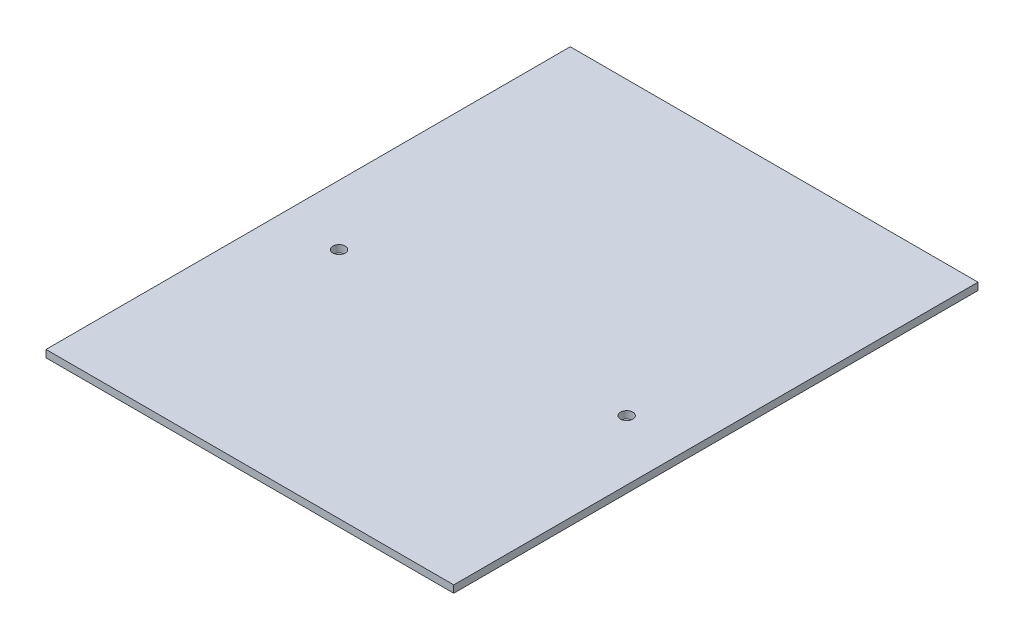
ISO-10303-21;
HEADER;
FILE_DESCRIPTION(('STEP AP214'),'2;1');
FILE_NAME('part.step','',(''),(''),'','','');
FILE_SCHEMA(('AUTOMOTIVE_DESIGN { 1 0 10303 214 1 1 1 1 }'));
ENDSEC;
DATA;
#1=APPLICATION_CONTEXT('core data for automotive mechanical design processes');
#2=APPLICATION_PROTOCOL_DEFINITION('international standard','automotive_design',2000,#1);
#3=PRODUCT_CONTEXT('',#1,'mechanical');
#4=PRODUCT('Part','Part','',(#3));
#5=PRODUCT_RELATED_PRODUCT_CATEGORY('part','',(#4));
#6=PRODUCT_DEFINITION_FORMATION('','',#4);
#7=PRODUCT_DEFINITION_CONTEXT('part definition',#1,'design');
#8=PRODUCT_DEFINITION('design','',#6,#7);
#9=PRODUCT_DEFINITION_SHAPE('','',#8);
#10=(LENGTH_UNIT() NAMED_UNIT(*) SI_UNIT(.MILLI.,.METRE.));
#11=(NAMED_UNIT(*) PLANE_ANGLE_UNIT() SI_UNIT($,.RADIAN.));
#12=(NAMED_UNIT(*) SI_UNIT($,.STERADIAN.) SOLID_ANGLE_UNIT());
#13=UNCERTAINTY_MEASURE_WITH_UNIT(LENGTH_MEASURE(1.E-05),#10,'distance_accuracy_value','');
#14=(GEOMETRIC_REPRESENTATION_CONTEXT(3) GLOBAL_UNCERTAINTY_ASSIGNED_CONTEXT((#13)) GLOBAL_UNIT_ASSIGNED_CONTEXT((#10,
#11,#12)) REPRESENTATION_CONTEXT('',''));
#15=CARTESIAN_POINT('',(0.,0.,0.));
#16=DIRECTION('',(0.,0.,1.));
#17=DIRECTION('',(1.,0.,0.));
#18=AXIS2_PLACEMENT_3D('',#15,#16,#17);
#19=CARTESIAN_POINT('',(0.,6.35,0.));
#20=DIRECTION('',(1.,0.,0.));
#21=DIRECTION('',(0.,0.,-1.));
#22=AXIS2_PLACEMENT_3D('',#19,#20,#21);
#23=PLANE('',#22);
#24=DIRECTION('',(0.,0.,1.));
#25=VECTOR('',#24,1.);
#26=CARTESIAN_POINT('',(0.,0.,0.));
#27=LINE('',#26,#25);
#28=CARTESIAN_POINT('',(0.,0.,-457.2));
#29=VERTEX_POINT('',#28);
#30=CARTESIAN_POINT('',(0.,0.,0.));
#31=VERTEX_POINT('',#30);
#32=EDGE_CURVE('E107',#29,#31,#27,.T.);
#33=ORIENTED_EDGE('',*,*,#32,.T.);
#34=DIRECTION('',(0.,-1.,0.));
#35=VECTOR('',#34,1.);
#36=CARTESIAN_POINT('',(0.,6.35,0.));
#37=LINE('',#36,#35);
#38=CARTESIAN_POINT('',(0.,6.35,0.));
#39=VERTEX_POINT('',#38);
#40=EDGE_CURVE('E11',#39,#31,#37,.T.);
#41=ORIENTED_EDGE('',*,*,#40,.F.);
#42=DIRECTION('',(0.,0.,1.));
#43=VECTOR('',#42,1.);
#44=CARTESIAN_POINT('',(0.,6.35,0.));
#45=LINE('',#44,#43);
#46=CARTESIAN_POINT('',(0.,6.35,-457.2));
#47=VERTEX_POINT('',#46);
#48=EDGE_CURVE('E94',#47,#39,#45,.T.);
#49=ORIENTED_EDGE('',*,*,#48,.F.);
#50=DIRECTION('',(0.,-1.,0.));
#51=VECTOR('',#50,1.);
#52=CARTESIAN_POINT('',(0.,6.35,-457.2));
#53=LINE('',#52,#51);
#54=EDGE_CURVE('E103',#47,#29,#53,.T.);
#55=ORIENTED_EDGE('',*,*,#54,.T.);
#56=EDGE_LOOP('',(#33,#41,#49,#55));
#57=FACE_BOUND('',#56,.T.);
#58=ADVANCED_FACE('F40',(#57),#23,.F.);
#59=CARTESIAN_POINT('',(0.,6.35,0.));
#60=DIRECTION('',(0.,0.,-1.));
#61=DIRECTION('',(-1.,0.,0.));
#62=AXIS2_PLACEMENT_3D('',#59,#60,#61);
#63=PLANE('',#62);
#64=DIRECTION('',(1.,0.,0.));
#65=VECTOR('',#64,1.);
#66=CARTESIAN_POINT('',(0.,0.,0.));
#67=LINE('',#66,#65);
#68=CARTESIAN_POINT('',(355.6,0.,0.));
#69=VERTEX_POINT('',#68);
#70=EDGE_CURVE('E99',#31,#69,#67,.T.);
#71=ORIENTED_EDGE('',*,*,#70,.T.);
#72=DIRECTION('',(0.,-1.,0.));
#73=VECTOR('',#72,1.);
#74=CARTESIAN_POINT('',(355.6,6.35,0.));
#75=LINE('',#74,#73);
#76=CARTESIAN_POINT('',(355.6,6.35,0.));
#77=VERTEX_POINT('',#76);
#78=EDGE_CURVE('E49',#77,#69,#75,.T.);
#79=ORIENTED_EDGE('',*,*,#78,.F.);
#80=DIRECTION('',(1.,0.,0.));
#81=VECTOR('',#80,1.);
#82=CARTESIAN_POINT('',(0.,6.35,0.));
#83=LINE('',#82,#81);
#84=EDGE_CURVE('E89',#39,#77,#83,.T.);
#85=ORIENTED_EDGE('',*,*,#84,.F.);
#86=ORIENTED_EDGE('',*,*,#40,.T.);
#87=EDGE_LOOP('',(#71,#79,#85,#86));
#88=FACE_BOUND('',#87,.T.);
#89=ADVANCED_FACE('F98',(#88),#63,.F.);
#90=CARTESIAN_POINT('',(355.6,6.35,0.));
#91=DIRECTION('',(-1.,0.,0.));
#92=DIRECTION('',(0.,0.,1.));
#93=AXIS2_PLACEMENT_3D('',#90,#91,#92);
#94=PLANE('',#93);
#95=DIRECTION('',(0.,0.,-1.));
#96=VECTOR('',#95,1.);
#97=CARTESIAN_POINT('',(355.6,0.,0.));
#98=LINE('',#97,#96);
#99=CARTESIAN_POINT('',(355.6,0.,-457.2));
#100=VERTEX_POINT('',#99);
#101=EDGE_CURVE('E75',#69,#100,#98,.T.);
#102=ORIENTED_EDGE('',*,*,#101,.T.);
#103=DIRECTION('',(0.,-1.,0.));
#104=VECTOR('',#103,1.);
#105=CARTESIAN_POINT('',(355.6,6.35,-457.2));
#106=LINE('',#105,#104);
#107=CARTESIAN_POINT('',(355.6,6.35,-457.2));
#108=VERTEX_POINT('',#107);
#109=EDGE_CURVE('E100',#108,#100,#106,.T.);
#110=ORIENTED_EDGE('',*,*,#109,.F.);
#111=DIRECTION('',(0.,0.,-1.));
#112=VECTOR('',#111,1.);
#113=CARTESIAN_POINT('',(355.6,6.35,0.));
#114=LINE('',#113,#112);
#115=EDGE_CURVE('E92',#77,#108,#114,.T.);
#116=ORIENTED_EDGE('',*,*,#115,.F.);
#117=ORIENTED_EDGE('',*,*,#78,.T.);
#118=EDGE_LOOP('',(#102,#110,#116,#117));
#119=FACE_BOUND('',#118,.T.);
#120=ADVANCED_FACE('F101',(#119),#94,.F.);
#121=CARTESIAN_POINT('',(0.,6.35,-457.2));
#122=DIRECTION('',(0.,0.,1.));
#123=DIRECTION('',(1.,0.,0.));
#124=AXIS2_PLACEMENT_3D('',#121,#122,#123);
#125=PLANE('',#124);
#126=DIRECTION('',(-1.,0.,0.));
#127=VECTOR('',#126,1.);
#128=CARTESIAN_POINT('',(0.,0.,-457.2));
#129=LINE('',#128,#127);
#130=EDGE_CURVE('E81',#100,#29,#129,.T.);
#131=ORIENTED_EDGE('',*,*,#130,.T.);
#132=ORIENTED_EDGE('',*,*,#54,.F.);
#133=DIRECTION('',(-1.,0.,0.));
#134=VECTOR('',#133,1.);
#135=CARTESIAN_POINT('',(0.,6.35,-457.2));
#136=LINE('',#135,#134);
#137=EDGE_CURVE('E57',#108,#47,#136,.T.);
#138=ORIENTED_EDGE('',*,*,#137,.F.);
#139=ORIENTED_EDGE('',*,*,#109,.T.);
#140=EDGE_LOOP('',(#131,#132,#138,#139));
#141=FACE_BOUND('',#140,.T.);
#142=ADVANCED_FACE('F117',(#141),#125,.F.);
#143=CARTESIAN_POINT('',(0.,6.35,0.));
#144=DIRECTION('',(0.,-1.,0.));
#145=DIRECTION('',(0.,0.,-1.));
#146=AXIS2_PLACEMENT_3D('',#143,#144,#145);
#147=PLANE('',#146);
#148=CARTESIAN_POINT('',(52.3875,6.35,-203.2));
#149=DIRECTION('',(0.,1.,0.));
#150=DIRECTION('',(0.,0.,1.));
#151=AXIS2_PLACEMENT_3D('',#148,#149,#150);
#152=CIRCLE('',#151,5.35787599999998);
#153=CARTESIAN_POINT('',(52.3875,6.35,-197.842124));
#154=VERTEX_POINT('',#153);
#155=EDGE_CURVE('E132',#154,#154,#152,.T.);
#156=ORIENTED_EDGE('',*,*,#155,.F.);
#157=EDGE_LOOP('',(#156));
#158=FACE_BOUND('',#157,.T.);
#159=CARTESIAN_POINT('',(303.2125,6.35,-203.2));
#160=DIRECTION('',(0.,1.,0.));
#161=DIRECTION('',(0.,0.,1.));
#162=AXIS2_PLACEMENT_3D('',#159,#160,#161);
#163=CIRCLE('',#162,5.35787599999998);
#164=CARTESIAN_POINT('',(303.2125,6.35,-197.842124));
#165=VERTEX_POINT('',#164);
#166=EDGE_CURVE('E126',#165,#165,#163,.T.);
#167=ORIENTED_EDGE('',*,*,#166,.F.);
#168=EDGE_LOOP('',(#167));
#169=FACE_BOUND('',#168,.T.);
#170=ORIENTED_EDGE('',*,*,#48,.T.);
#171=ORIENTED_EDGE('',*,*,#84,.T.);
#172=ORIENTED_EDGE('',*,*,#115,.T.);
#173=ORIENTED_EDGE('',*,*,#137,.T.);
#174=EDGE_LOOP('',(#170,#171,#172,#173));
#175=FACE_BOUND('',#174,.T.);
#176=ADVANCED_FACE('F90',(#158,#169,#175),#147,.F.);
#177=CARTESIAN_POINT('',(0.,0.,0.));
#178=DIRECTION('',(0.,-1.,0.));
#179=DIRECTION('',(0.,0.,-1.));
#180=AXIS2_PLACEMENT_3D('',#177,#178,#179);
#181=PLANE('',#180);
#182=CARTESIAN_POINT('',(52.3875,0.,-203.2));
#183=DIRECTION('',(0.,1.,0.));
#184=DIRECTION('',(0.,0.,1.));
#185=AXIS2_PLACEMENT_3D('',#182,#183,#184);
#186=CIRCLE('',#185,5.357876);
#187=CARTESIAN_POINT('',(52.3875,0.,-197.842124));
#188=VERTEX_POINT('',#187);
#189=EDGE_CURVE('E129',#188,#188,#186,.T.);
#190=ORIENTED_EDGE('',*,*,#189,.T.);
#191=EDGE_LOOP('',(#190));
#192=FACE_BOUND('',#191,.T.);
#193=CARTESIAN_POINT('',(303.2125,0.,-203.2));
#194=DIRECTION('',(0.,1.,0.));
#195=DIRECTION('',(0.,0.,1.));
#196=AXIS2_PLACEMENT_3D('',#193,#194,#195);
#197=CIRCLE('',#196,5.35787599999998);
#198=CARTESIAN_POINT('',(303.2125,0.,-197.842124));
#199=VERTEX_POINT('',#198);
#200=EDGE_CURVE('E111',#199,#199,#197,.T.);
#201=ORIENTED_EDGE('',*,*,#200,.T.);
#202=EDGE_LOOP('',(#201));
#203=FACE_BOUND('',#202,.T.);
#204=ORIENTED_EDGE('',*,*,#32,.F.);
#205=ORIENTED_EDGE('',*,*,#130,.F.);
#206=ORIENTED_EDGE('',*,*,#101,.F.);
#207=ORIENTED_EDGE('',*,*,#70,.F.);
#208=EDGE_LOOP('',(#204,#205,#206,#207));
#209=FACE_BOUND('',#208,.T.);
#210=ADVANCED_FACE('F120',(#192,#203,#209),#181,.T.);
#211=CARTESIAN_POINT('',(303.2125,6.35,-203.2));
#212=DIRECTION('',(0.,1.,0.));
#213=DIRECTION('',(0.,0.,1.));
#214=AXIS2_PLACEMENT_3D('',#211,#212,#213);
#215=CYLINDRICAL_SURFACE('',#214,5.35787599999998);
#216=ORIENTED_EDGE('',*,*,#200,.F.);
#217=EDGE_LOOP('',(#216));
#218=FACE_BOUND('',#217,.T.);
#219=ORIENTED_EDGE('',*,*,#166,.T.);
#220=EDGE_LOOP('',(#219));
#221=FACE_BOUND('',#220,.T.);
#222=ADVANCED_FACE('F143',(#218,#221),#215,.F.);
#223=CARTESIAN_POINT('',(52.3875,6.35,-203.2));
#224=DIRECTION('',(0.,1.,0.));
#225=DIRECTION('',(0.,0.,1.));
#226=AXIS2_PLACEMENT_3D('',#223,#224,#225);
#227=CYLINDRICAL_SURFACE('',#226,5.35787599999999);
#228=ORIENTED_EDGE('',*,*,#189,.F.);
#229=EDGE_LOOP('',(#228));
#230=FACE_BOUND('',#229,.T.);
#231=ORIENTED_EDGE('',*,*,#155,.T.);
#232=EDGE_LOOP('',(#231));
#233=FACE_BOUND('',#232,.T.);
#234=ADVANCED_FACE('F136',(#230,#233),#227,.F.);
#235=CLOSED_SHELL('',(#58,#89,#120,#142,#176,#210,#222,#234));
#236=MANIFOLD_SOLID_BREP('B2',#235);
#237=ADVANCED_BREP_SHAPE_REPRESENTATION('',(#18,#236),#14);
#238=SHAPE_DEFINITION_REPRESENTATION(#9,#237);
ENDSEC;
END-ISO-10303-21;
